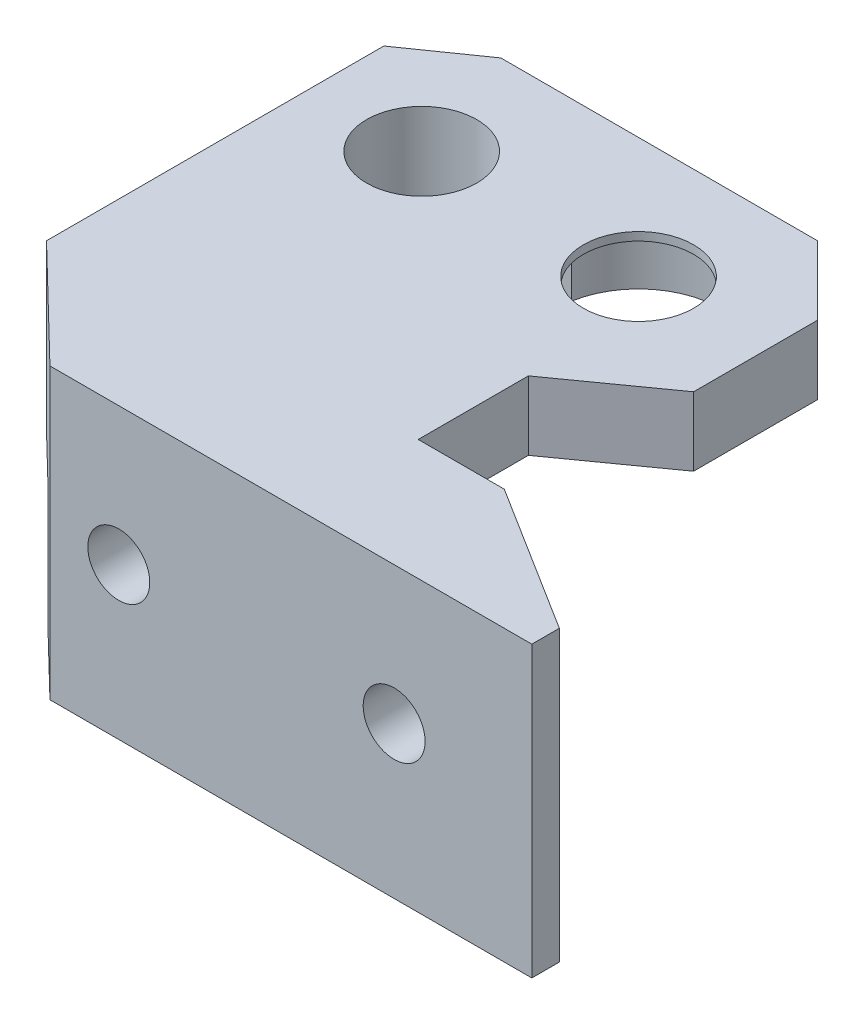
ISO-10303-21;
HEADER;
FILE_DESCRIPTION(('STEP AP214'),'2;1');
FILE_NAME('part.step','',(''),(''),'','','');
FILE_SCHEMA(('AUTOMOTIVE_DESIGN { 1 0 10303 214 1 1 1 1 }'));
ENDSEC;
DATA;
#1=APPLICATION_CONTEXT('core data for automotive mechanical design processes');
#2=APPLICATION_PROTOCOL_DEFINITION('international standard','automotive_design',2000,#1);
#3=PRODUCT_CONTEXT('',#1,'mechanical');
#4=PRODUCT('Part','Part','',(#3));
#5=PRODUCT_RELATED_PRODUCT_CATEGORY('part','',(#4));
#6=PRODUCT_DEFINITION_FORMATION('','',#4);
#7=PRODUCT_DEFINITION_CONTEXT('part definition',#1,'design');
#8=PRODUCT_DEFINITION('design','',#6,#7);
#9=PRODUCT_DEFINITION_SHAPE('','',#8);
#10=(LENGTH_UNIT() NAMED_UNIT(*) SI_UNIT(.MILLI.,.METRE.));
#11=(NAMED_UNIT(*) PLANE_ANGLE_UNIT() SI_UNIT($,.RADIAN.));
#12=(NAMED_UNIT(*) SI_UNIT($,.STERADIAN.) SOLID_ANGLE_UNIT());
#13=UNCERTAINTY_MEASURE_WITH_UNIT(LENGTH_MEASURE(1.E-05),#10,'distance_accuracy_value','');
#14=(GEOMETRIC_REPRESENTATION_CONTEXT(3) GLOBAL_UNCERTAINTY_ASSIGNED_CONTEXT((#13)) GLOBAL_UNIT_ASSIGNED_CONTEXT((#10,
#11,#12)) REPRESENTATION_CONTEXT('',''));
#15=CARTESIAN_POINT('',(0.,0.,0.));
#16=DIRECTION('',(0.,0.,1.));
#17=DIRECTION('',(1.,0.,0.));
#18=AXIS2_PLACEMENT_3D('',#15,#16,#17);
#19=CARTESIAN_POINT('',(-38.5,-7.,0.));
#20=DIRECTION('',(0.,1.,0.));
#21=DIRECTION('',(0.,0.,1.));
#22=AXIS2_PLACEMENT_3D('',#19,#20,#21);
#23=PLANE('',#22);
#24=DIRECTION('',(0.,0.,-1.));
#25=VECTOR('',#24,1.);
#26=CARTESIAN_POINT('',(-52.7141016151378,-7.,22.25));
#27=LINE('',#26,#25);
#28=CARTESIAN_POINT('',(-52.7141016151378,-7.,22.25));
#29=VERTEX_POINT('',#28);
#30=CARTESIAN_POINT('',(-52.7141016151378,-7.,18.25));
#31=VERTEX_POINT('',#30);
#32=EDGE_CURVE('E467',#29,#31,#27,.T.);
#33=ORIENTED_EDGE('',*,*,#32,.F.);
#34=DIRECTION('',(1.,0.,0.));
#35=VECTOR('',#34,1.);
#36=CARTESIAN_POINT('',(-23.6296296296296,-7.,22.25));
#37=LINE('',#36,#35);
#38=CARTESIAN_POINT('',(-59.1532258064516,-7.,22.25));
#39=VERTEX_POINT('',#38);
#40=EDGE_CURVE('E333',#39,#29,#37,.T.);
#41=ORIENTED_EDGE('',*,*,#40,.F.);
#42=DIRECTION('',(0.718240222789174,0.,0.695795215827012));
#43=VECTOR('',#42,1.);
#44=CARTESIAN_POINT('',(-59.1532258064516,-7.,22.25));
#45=LINE('',#44,#43);
#46=CARTESIAN_POINT('',(-62.25,-7.,19.25));
#47=VERTEX_POINT('',#46);
#48=EDGE_CURVE('E347',#47,#39,#45,.T.);
#49=ORIENTED_EDGE('',*,*,#48,.F.);
#50=DIRECTION('',(0.,0.,1.));
#51=VECTOR('',#50,1.);
#52=CARTESIAN_POINT('',(-62.25,-7.,19.25));
#53=LINE('',#52,#51);
#54=CARTESIAN_POINT('',(-62.25,-7.,-5.25));
#55=VERTEX_POINT('',#54);
#56=EDGE_CURVE('E538',#55,#47,#53,.T.);
#57=ORIENTED_EDGE('',*,*,#56,.F.);
#58=DIRECTION('',(-1.,0.,0.));
#59=VECTOR('',#58,1.);
#60=CARTESIAN_POINT('',(-62.25,-7.,-5.25));
#61=LINE('',#60,#59);
#62=CARTESIAN_POINT('',(-58.75,-7.,-5.25));
#63=VERTEX_POINT('',#62);
#64=EDGE_CURVE('E541',#63,#55,#61,.T.);
#65=ORIENTED_EDGE('',*,*,#64,.F.);
#66=DIRECTION('',(0.,0.,-1.));
#67=VECTOR('',#66,1.);
#68=CARTESIAN_POINT('',(-58.75,-7.,-5.25));
#69=LINE('',#68,#67);
#70=CARTESIAN_POINT('',(-58.75,-7.,18.25));
#71=VERTEX_POINT('',#70);
#72=EDGE_CURVE('E543',#71,#63,#69,.T.);
#73=ORIENTED_EDGE('',*,*,#72,.F.);
#74=DIRECTION('',(-1.,0.,0.));
#75=VECTOR('',#74,1.);
#76=CARTESIAN_POINT('',(-58.75,-7.,18.25));
#77=LINE('',#76,#75);
#78=EDGE_CURVE('E335',#31,#71,#77,.T.);
#79=ORIENTED_EDGE('',*,*,#78,.F.);
#80=EDGE_LOOP('',(#33,#41,#49,#57,#65,#73,#79));
#81=FACE_BOUND('',#80,.T.);
#82=ADVANCED_FACE('F35',(#81),#23,.F.);
#83=DIRECTION('',(0.,0.,-1.));
#84=VECTOR('',#83,1.);
#85=CARTESIAN_POINT('',(-45.7858983848622,-7.,22.25));
#86=LINE('',#85,#84);
#87=CARTESIAN_POINT('',(-45.7858983848622,-7.,18.25));
#88=VERTEX_POINT('',#87);
#89=CARTESIAN_POINT('',(-45.7858983848622,-7.,22.25));
#90=VERTEX_POINT('',#89);
#91=EDGE_CURVE('E464',#88,#90,#86,.F.);
#92=ORIENTED_EDGE('',*,*,#91,.F.);
#93=CARTESIAN_POINT('',(-32.7141016151378,-7.,18.25));
#94=VERTEX_POINT('',#93);
#95=EDGE_CURVE('E329',#94,#88,#77,.T.);
#96=ORIENTED_EDGE('',*,*,#95,.F.);
#97=DIRECTION('',(0.,0.,-1.));
#98=VECTOR('',#97,1.);
#99=CARTESIAN_POINT('',(-32.7141016151378,-7.,22.25));
#100=LINE('',#99,#98);
#101=CARTESIAN_POINT('',(-32.7141016151378,-7.,22.25));
#102=VERTEX_POINT('',#101);
#103=EDGE_CURVE('E322',#102,#94,#100,.T.);
#104=ORIENTED_EDGE('',*,*,#103,.F.);
#105=EDGE_CURVE('E331',#90,#102,#37,.T.);
#106=ORIENTED_EDGE('',*,*,#105,.F.);
#107=EDGE_LOOP('',(#92,#96,#104,#106));
#108=FACE_BOUND('',#107,.T.);
#109=ADVANCED_FACE('F294',(#108),#23,.F.);
#110=DIRECTION('',(0.,0.,-1.));
#111=VECTOR('',#110,1.);
#112=CARTESIAN_POINT('',(-25.7858983848622,-7.,22.25));
#113=LINE('',#112,#111);
#114=CARTESIAN_POINT('',(-25.7858983848622,-7.,20.8960638048539));
#115=VERTEX_POINT('',#114);
#116=CARTESIAN_POINT('',(-25.7858983848622,-7.,22.25));
#117=VERTEX_POINT('',#116);
#118=EDGE_CURVE('E315',#115,#117,#113,.F.);
#119=ORIENTED_EDGE('',*,*,#118,.F.);
#120=DIRECTION('',(-0.846889988853068,0.,-0.531768132535647));
#121=VECTOR('',#120,1.);
#122=CARTESIAN_POINT('',(-30.,-7.,18.25));
#123=LINE('',#122,#121);
#124=CARTESIAN_POINT('',(-23.6296296296296,-7.,22.25));
#125=VERTEX_POINT('',#124);
#126=EDGE_CURVE('E317',#125,#115,#123,.T.);
#127=ORIENTED_EDGE('',*,*,#126,.F.);
#128=EDGE_CURVE('E319',#117,#125,#37,.T.);
#129=ORIENTED_EDGE('',*,*,#128,.F.);
#130=EDGE_LOOP('',(#119,#127,#129));
#131=FACE_BOUND('',#130,.T.);
#132=ADVANCED_FACE('F297',(#131),#23,.F.);
#133=CARTESIAN_POINT('',(-19.25,5.,25.));
#134=DIRECTION('',(0.531768132535647,0.,-0.846889988853068));
#135=DIRECTION('',(-0.846889988853068,0.,-0.531768132535647));
#136=AXIS2_PLACEMENT_3D('',#133,#134,#135);
#137=PLANE('',#136);
#138=ORIENTED_EDGE('',*,*,#126,.T.);
#139=CARTESIAN_POINT('',(-29.25,-5.,18.7209302325581));
#140=DIRECTION('',(0.531768132535647,0.,-0.846889988853068));
#141=DIRECTION('',(-0.846889988853068,0.,-0.531768132535647));
#142=AXIS2_PLACEMENT_3D('',#139,#140,#141);
#143=ELLIPSE('',#142,4.72316363712971,4.);
#144=CARTESIAN_POINT('',(-30.,-1.07094158862457,18.25));
#145=VERTEX_POINT('',#144);
#146=EDGE_CURVE('E323',#115,#145,#143,.F.);
#147=ORIENTED_EDGE('',*,*,#146,.T.);
#148=DIRECTION('',(0.,-1.,0.));
#149=VECTOR('',#148,1.);
#150=CARTESIAN_POINT('',(-30.,5.,18.25));
#151=LINE('',#150,#149);
#152=CARTESIAN_POINT('',(-30.,5.,18.25));
#153=VERTEX_POINT('',#152);
#154=EDGE_CURVE('E414',#153,#145,#151,.T.);
#155=ORIENTED_EDGE('',*,*,#154,.F.);
#156=DIRECTION('',(0.846889988853068,0.,0.531768132535647));
#157=VECTOR('',#156,1.);
#158=CARTESIAN_POINT('',(-19.25,5.,25.));
#159=LINE('',#158,#157);
#160=CARTESIAN_POINT('',(-19.25,5.,25.));
#161=VERTEX_POINT('',#160);
#162=EDGE_CURVE('E375',#153,#161,#159,.T.);
#163=ORIENTED_EDGE('',*,*,#162,.T.);
#164=DIRECTION('',(0.,-1.,0.));
#165=VECTOR('',#164,1.);
#166=CARTESIAN_POINT('',(-19.25,5.,25.));
#167=LINE('',#166,#165);
#168=CARTESIAN_POINT('',(-19.25,-16.,25.));
#169=VERTEX_POINT('',#168);
#170=EDGE_CURVE('E225',#161,#169,#167,.T.);
#171=ORIENTED_EDGE('',*,*,#170,.T.);
#172=DIRECTION('',(-0.846889988853068,0.,-0.531768132535647));
#173=VECTOR('',#172,1.);
#174=CARTESIAN_POINT('',(-19.25,-16.,25.));
#175=LINE('',#174,#173);
#176=CARTESIAN_POINT('',(-23.6296296296296,-16.,22.25));
#177=VERTEX_POINT('',#176);
#178=EDGE_CURVE('E526',#169,#177,#175,.T.);
#179=ORIENTED_EDGE('',*,*,#178,.T.);
#180=DIRECTION('',(0.,1.,0.));
#181=VECTOR('',#180,1.);
#182=CARTESIAN_POINT('',(-23.6296296296296,-16.,22.25));
#183=LINE('',#182,#181);
#184=EDGE_CURVE('E328',#177,#125,#183,.T.);
#185=ORIENTED_EDGE('',*,*,#184,.T.);
#186=EDGE_LOOP('',(#138,#147,#155,#163,#171,#179,#185));
#187=FACE_BOUND('',#186,.T.);
#188=ADVANCED_FACE('F288',(#187),#137,.T.);
#189=CARTESIAN_POINT('',(-29.25,-5.,-8.75));
#190=DIRECTION('',(0.,0.,1.));
#191=DIRECTION('',(1.,0.,0.));
#192=AXIS2_PLACEMENT_3D('',#189,#190,#191);
#193=CYLINDRICAL_SURFACE('',#192,2.25);
#194=CARTESIAN_POINT('',(-29.25,-5.,27.));
#195=DIRECTION('',(0.,0.,-1.));
#196=DIRECTION('',(-1.,0.,0.));
#197=AXIS2_PLACEMENT_3D('',#194,#195,#196);
#198=CIRCLE('',#197,2.25);
#199=CARTESIAN_POINT('',(-31.5,-5.,27.));
#200=VERTEX_POINT('',#199);
#201=EDGE_CURVE('E469',#200,#200,#198,.T.);
#202=ORIENTED_EDGE('',*,*,#201,.F.);
#203=EDGE_LOOP('',(#202));
#204=FACE_BOUND('',#203,.T.);
#205=CARTESIAN_POINT('',(-29.25,-5.,22.25));
#206=DIRECTION('',(0.,0.,-1.));
#207=DIRECTION('',(-1.,0.,0.));
#208=AXIS2_PLACEMENT_3D('',#205,#206,#207);
#209=CIRCLE('',#208,2.25);
#210=CARTESIAN_POINT('',(-31.5,-5.,22.25));
#211=VERTEX_POINT('',#210);
#212=EDGE_CURVE('E266',#211,#211,#209,.F.);
#213=ORIENTED_EDGE('',*,*,#212,.F.);
#214=EDGE_LOOP('',(#213));
#215=FACE_BOUND('',#214,.T.);
#216=ADVANCED_FACE('F277',(#204,#215),#193,.F.);
#217=CARTESIAN_POINT('',(-49.25,-5.,-8.75));
#218=DIRECTION('',(0.,0.,1.));
#219=DIRECTION('',(1.,0.,0.));
#220=AXIS2_PLACEMENT_3D('',#217,#218,#219);
#221=CYLINDRICAL_SURFACE('',#220,2.25);
#222=CARTESIAN_POINT('',(-49.25,-5.,27.));
#223=DIRECTION('',(0.,0.,-1.));
#224=DIRECTION('',(-1.,0.,0.));
#225=AXIS2_PLACEMENT_3D('',#222,#223,#224);
#226=CIRCLE('',#225,2.25);
#227=CARTESIAN_POINT('',(-51.5,-5.,27.));
#228=VERTEX_POINT('',#227);
#229=EDGE_CURVE('E473',#228,#228,#226,.T.);
#230=ORIENTED_EDGE('',*,*,#229,.F.);
#231=EDGE_LOOP('',(#230));
#232=FACE_BOUND('',#231,.T.);
#233=CARTESIAN_POINT('',(-49.25,-5.,22.25));
#234=DIRECTION('',(0.,0.,-1.));
#235=DIRECTION('',(-1.,0.,0.));
#236=AXIS2_PLACEMENT_3D('',#233,#234,#235);
#237=CIRCLE('',#236,2.25);
#238=CARTESIAN_POINT('',(-51.5,-5.,22.25));
#239=VERTEX_POINT('',#238);
#240=EDGE_CURVE('E43',#239,#239,#237,.F.);
#241=ORIENTED_EDGE('',*,*,#240,.F.);
#242=EDGE_LOOP('',(#241));
#243=FACE_BOUND('',#242,.T.);
#244=ADVANCED_FACE('F274',(#232,#243),#221,.F.);
#245=CARTESIAN_POINT('',(-54.25,-2.5,0.));
#246=DIRECTION('',(0.,1.,0.));
#247=DIRECTION('',(0.,0.,1.));
#248=AXIS2_PLACEMENT_3D('',#245,#246,#247);
#249=CYLINDRICAL_SURFACE('',#248,7.);
#250=DIRECTION('',(0.,1.,0.));
#251=VECTOR('',#250,1.);
#252=CARTESIAN_POINT('',(-47.3217967697245,-2.5,1.));
#253=LINE('',#252,#251);
#254=CARTESIAN_POINT('',(-47.3217967697245,0.,1.));
#255=VERTEX_POINT('',#254);
#256=CARTESIAN_POINT('',(-47.3217967697245,-2.5,1.));
#257=VERTEX_POINT('',#256);
#258=EDGE_CURVE('E482',#255,#257,#253,.F.);
#259=ORIENTED_EDGE('',*,*,#258,.F.);
#260=CARTESIAN_POINT('',(-54.25,0.,0.));
#261=DIRECTION('',(0.,1.,0.));
#262=DIRECTION('',(0.,0.,-1.));
#263=AXIS2_PLACEMENT_3D('',#260,#261,#262);
#264=CIRCLE('',#263,7.);
#265=CARTESIAN_POINT('',(-58.75,0.,5.36190264738181));
#266=VERTEX_POINT('',#265);
#267=EDGE_CURVE('E519',#266,#255,#264,.T.);
#268=ORIENTED_EDGE('',*,*,#267,.F.);
#269=DIRECTION('',(0.,1.,0.));
#270=VECTOR('',#269,1.);
#271=CARTESIAN_POINT('',(-58.75,-2.5,5.36190264738181));
#272=LINE('',#271,#270);
#273=CARTESIAN_POINT('',(-58.75,-2.5,5.36190264738181));
#274=VERTEX_POINT('',#273);
#275=EDGE_CURVE('E257',#266,#274,#272,.F.);
#276=ORIENTED_EDGE('',*,*,#275,.T.);
#277=CARTESIAN_POINT('',(-54.25,-2.5,0.));
#278=DIRECTION('',(0.,1.,0.));
#279=DIRECTION('',(0.,0.,-1.));
#280=AXIS2_PLACEMENT_3D('',#277,#278,#279);
#281=CIRCLE('',#280,7.);
#282=EDGE_CURVE('E515',#274,#257,#281,.T.);
#283=ORIENTED_EDGE('',*,*,#282,.T.);
#284=EDGE_LOOP('',(#259,#268,#276,#283));
#285=FACE_BOUND('',#284,.T.);
#286=ADVANCED_FACE('F276',(#285),#249,.T.);
#287=CARTESIAN_POINT('',(-38.5,0.,0.));
#288=DIRECTION('',(0.,1.,0.));
#289=DIRECTION('',(0.,0.,1.));
#290=AXIS2_PLACEMENT_3D('',#287,#288,#289);
#291=PLANE('',#290);
#292=DIRECTION('',(-1.,0.,0.));
#293=VECTOR('',#292,1.);
#294=CARTESIAN_POINT('',(-44.3837822935834,0.,-1.));
#295=LINE('',#294,#293);
#296=CARTESIAN_POINT('',(-44.3837822935834,0.,-1.));
#297=VERTEX_POINT('',#296);
#298=CARTESIAN_POINT('',(-47.3217967697245,0.,-1.));
#299=VERTEX_POINT('',#298);
#300=EDGE_CURVE('E492',#297,#299,#295,.T.);
#301=ORIENTED_EDGE('',*,*,#300,.T.);
#302=CARTESIAN_POINT('',(-58.880064794363,0.,-5.25));
#303=VERTEX_POINT('',#302);
#304=EDGE_CURVE('E514',#299,#303,#264,.T.);
#305=ORIENTED_EDGE('',*,*,#304,.T.);
#306=DIRECTION('',(-1.,0.,0.));
#307=VECTOR('',#306,1.);
#308=CARTESIAN_POINT('',(-62.25,0.,-5.25));
#309=LINE('',#308,#307);
#310=CARTESIAN_POINT('',(-62.25,0.,-5.25));
#311=VERTEX_POINT('',#310);
#312=EDGE_CURVE('E341',#303,#311,#309,.T.);
#313=ORIENTED_EDGE('',*,*,#312,.T.);
#314=DIRECTION('',(0.819231920519041,0.,-0.573462344363328));
#315=VECTOR('',#314,1.);
#316=CARTESIAN_POINT('',(-57.25,0.,-8.75));
#317=LINE('',#316,#315);
#318=CARTESIAN_POINT('',(-57.25,0.,-8.75));
#319=VERTEX_POINT('',#318);
#320=EDGE_CURVE('E395',#311,#319,#317,.T.);
#321=ORIENTED_EDGE('',*,*,#320,.T.);
#322=DIRECTION('',(1.,0.,0.));
#323=VECTOR('',#322,1.);
#324=CARTESIAN_POINT('',(-34.25,0.,-8.75));
#325=LINE('',#324,#323);
#326=CARTESIAN_POINT('',(-34.25,0.,-8.75));
#327=VERTEX_POINT('',#326);
#328=EDGE_CURVE('E392',#319,#327,#325,.T.);
#329=ORIENTED_EDGE('',*,*,#328,.T.);
#330=DIRECTION('',(0.707106781186547,0.,0.707106781186548));
#331=VECTOR('',#330,1.);
#332=CARTESIAN_POINT('',(-29.25,0.,-3.75));
#333=LINE('',#332,#331);
#334=CARTESIAN_POINT('',(-29.25,0.,-3.75));
#335=VERTEX_POINT('',#334);
#336=EDGE_CURVE('E360',#327,#335,#333,.T.);
#337=ORIENTED_EDGE('',*,*,#336,.T.);
#338=DIRECTION('',(0.,0.,1.));
#339=VECTOR('',#338,1.);
#340=CARTESIAN_POINT('',(-29.25,0.,5.25));
#341=LINE('',#340,#339);
#342=CARTESIAN_POINT('',(-29.25,0.,5.25));
#343=VERTEX_POINT('',#342);
#344=EDGE_CURVE('E365',#335,#343,#341,.T.);
#345=ORIENTED_EDGE('',*,*,#344,.T.);
#346=DIRECTION('',(-0.813733471206735,0.,0.581238193719096));
#347=VECTOR('',#346,1.);
#348=CARTESIAN_POINT('',(-36.25,0.,10.25));
#349=LINE('',#348,#347);
#350=CARTESIAN_POINT('',(-36.25,0.,10.25));
#351=VERTEX_POINT('',#350);
#352=EDGE_CURVE('E401',#343,#351,#349,.T.);
#353=ORIENTED_EDGE('',*,*,#352,.T.);
#354=DIRECTION('',(0.,0.,1.));
#355=VECTOR('',#354,1.);
#356=CARTESIAN_POINT('',(-36.25,0.,18.25));
#357=LINE('',#356,#355);
#358=CARTESIAN_POINT('',(-36.25,0.,18.25));
#359=VERTEX_POINT('',#358);
#360=EDGE_CURVE('E398',#351,#359,#357,.T.);
#361=ORIENTED_EDGE('',*,*,#360,.T.);
#362=DIRECTION('',(-1.,0.,0.));
#363=VECTOR('',#362,1.);
#364=CARTESIAN_POINT('',(-38.5,0.,18.25));
#365=LINE('',#364,#363);
#366=CARTESIAN_POINT('',(-58.75,0.,18.25));
#367=VERTEX_POINT('',#366);
#368=EDGE_CURVE('E246',#359,#367,#365,.T.);
#369=ORIENTED_EDGE('',*,*,#368,.T.);
#370=DIRECTION('',(0.,0.,-1.));
#371=VECTOR('',#370,1.);
#372=CARTESIAN_POINT('',(-58.75,0.,-5.25));
#373=LINE('',#372,#371);
#374=EDGE_CURVE('E343',#367,#266,#373,.T.);
#375=ORIENTED_EDGE('',*,*,#374,.T.);
#376=ORIENTED_EDGE('',*,*,#267,.T.);
#377=DIRECTION('',(1.,0.,0.));
#378=VECTOR('',#377,1.);
#379=CARTESIAN_POINT('',(-44.3837822935834,0.,1.));
#380=LINE('',#379,#378);
#381=CARTESIAN_POINT('',(-44.3837822935834,0.,1.));
#382=VERTEX_POINT('',#381);
#383=EDGE_CURVE('E500',#255,#382,#380,.T.);
#384=ORIENTED_EDGE('',*,*,#383,.T.);
#385=CARTESIAN_POINT('',(-38.5,0.,0.));
#386=DIRECTION('',(0.,1.,0.));
#387=DIRECTION('',(0.,0.,-1.));
#388=AXIS2_PLACEMENT_3D('',#385,#386,#387);
#389=CIRCLE('',#388,5.96815667340306);
#390=EDGE_CURVE('E487',#382,#297,#389,.T.);
#391=ORIENTED_EDGE('',*,*,#390,.T.);
#392=EDGE_LOOP('',(#301,#305,#313,#321,#329,#337,#345,#353,#361,#369,#375,#376,#384,#391));
#393=FACE_BOUND('',#392,.T.);
#394=ADVANCED_FACE('F284',(#393),#291,.F.);
#395=CARTESIAN_POINT('',(-38.5,5.,0.));
#396=DIRECTION('',(0.,-1.,0.));
#397=DIRECTION('',(0.,0.,-1.));
#398=AXIS2_PLACEMENT_3D('',#395,#396,#397);
#399=CYLINDRICAL_SURFACE('',#398,4.);
#400=CARTESIAN_POINT('',(-38.5,5.,0.));
#401=DIRECTION('',(0.,-1.,0.));
#402=DIRECTION('',(0.,0.,1.));
#403=AXIS2_PLACEMENT_3D('',#400,#401,#402);
#404=CIRCLE('',#403,4.);
#405=CARTESIAN_POINT('',(-38.5,5.,4.));
#406=VERTEX_POINT('',#405);
#407=EDGE_CURVE('E357',#406,#406,#404,.T.);
#408=ORIENTED_EDGE('',*,*,#407,.F.);
#409=EDGE_LOOP('',(#408));
#410=FACE_BOUND('',#409,.T.);
#411=CARTESIAN_POINT('',(-38.5,4.4,0.));
#412=DIRECTION('',(0.,-1.,0.));
#413=DIRECTION('',(0.,0.,-1.));
#414=AXIS2_PLACEMENT_3D('',#411,#412,#413);
#415=CIRCLE('',#414,4.);
#416=CARTESIAN_POINT('',(-38.5,4.4,-4.));
#417=VERTEX_POINT('',#416);
#418=EDGE_CURVE('E507',#417,#417,#415,.F.);
#419=ORIENTED_EDGE('',*,*,#418,.F.);
#420=EDGE_LOOP('',(#419));
#421=FACE_BOUND('',#420,.T.);
#422=ADVANCED_FACE('F590',(#410,#421),#399,.F.);
#423=CARTESIAN_POINT('',(-54.25,5.,0.));
#424=DIRECTION('',(0.,-1.,0.));
#425=DIRECTION('',(0.,0.,-1.));
#426=AXIS2_PLACEMENT_3D('',#423,#424,#425);
#427=CYLINDRICAL_SURFACE('',#426,4.);
#428=DIRECTION('',(0.,-1.,0.));
#429=VECTOR('',#428,1.);
#430=CARTESIAN_POINT('',(-50.3770166537926,5.,1.));
#431=LINE('',#430,#429);
#432=CARTESIAN_POINT('',(-50.3770166537926,-2.5,0.999999999999999));
#433=VERTEX_POINT('',#432);
#434=CARTESIAN_POINT('',(-50.3770166537926,4.4,1.));
#435=VERTEX_POINT('',#434);
#436=EDGE_CURVE('E260',#433,#435,#431,.F.);
#437=ORIENTED_EDGE('',*,*,#436,.F.);
#438=CARTESIAN_POINT('',(-54.25,-2.5,0.));
#439=DIRECTION('',(0.,1.,0.));
#440=DIRECTION('',(0.,0.,-1.));
#441=AXIS2_PLACEMENT_3D('',#438,#439,#440);
#442=CIRCLE('',#441,4.);
#443=CARTESIAN_POINT('',(-50.3770166537926,-2.5,-1.));
#444=VERTEX_POINT('',#443);
#445=EDGE_CURVE('E511',#444,#433,#442,.T.);
#446=ORIENTED_EDGE('',*,*,#445,.F.);
#447=DIRECTION('',(0.,-1.,0.));
#448=VECTOR('',#447,1.);
#449=CARTESIAN_POINT('',(-50.3770166537926,5.,-1.));
#450=LINE('',#449,#448);
#451=CARTESIAN_POINT('',(-50.3770166537926,4.4,-1.));
#452=VERTEX_POINT('',#451);
#453=EDGE_CURVE('E262',#452,#444,#450,.T.);
#454=ORIENTED_EDGE('',*,*,#453,.F.);
#455=CARTESIAN_POINT('',(-54.25,4.4,0.));
#456=DIRECTION('',(0.,-1.,0.));
#457=DIRECTION('',(0.,0.,-1.));
#458=AXIS2_PLACEMENT_3D('',#455,#456,#457);
#459=CIRCLE('',#458,4.);
#460=EDGE_CURVE('E264',#435,#452,#459,.F.);
#461=ORIENTED_EDGE('',*,*,#460,.F.);
#462=EDGE_LOOP('',(#437,#446,#454,#461));
#463=FACE_BOUND('',#462,.T.);
#464=CARTESIAN_POINT('',(-54.25,5.,0.));
#465=DIRECTION('',(0.,-1.,0.));
#466=DIRECTION('',(0.,0.,1.));
#467=AXIS2_PLACEMENT_3D('',#464,#465,#466);
#468=CIRCLE('',#467,4.);
#469=CARTESIAN_POINT('',(-54.25,5.,4.));
#470=VERTEX_POINT('',#469);
#471=EDGE_CURVE('E354',#470,#470,#468,.T.);
#472=ORIENTED_EDGE('',*,*,#471,.F.);
#473=EDGE_LOOP('',(#472));
#474=FACE_BOUND('',#473,.T.);
#475=ADVANCED_FACE('F580',(#463,#474),#427,.F.);
#476=CARTESIAN_POINT('',(0.,5.,0.));
#477=DIRECTION('',(0.,1.,0.));
#478=DIRECTION('',(0.,0.,1.));
#479=AXIS2_PLACEMENT_3D('',#476,#477,#478);
#480=PLANE('',#479);
#481=DIRECTION('',(0.,0.,1.));
#482=VECTOR('',#481,1.);
#483=CARTESIAN_POINT('',(-19.25,5.,27.));
#484=LINE('',#483,#482);
#485=CARTESIAN_POINT('',(-19.25,5.,27.));
#486=VERTEX_POINT('',#485);
#487=EDGE_CURVE('E222',#161,#486,#484,.T.);
#488=ORIENTED_EDGE('',*,*,#487,.F.);
#489=ORIENTED_EDGE('',*,*,#162,.F.);
#490=DIRECTION('',(1.,0.,0.));
#491=VECTOR('',#490,1.);
#492=CARTESIAN_POINT('',(-30.,5.,18.25));
#493=LINE('',#492,#491);
#494=CARTESIAN_POINT('',(-36.25,5.,18.25));
#495=VERTEX_POINT('',#494);
#496=EDGE_CURVE('E377',#495,#153,#493,.T.);
#497=ORIENTED_EDGE('',*,*,#496,.F.);
#498=DIRECTION('',(0.,0.,1.));
#499=VECTOR('',#498,1.);
#500=CARTESIAN_POINT('',(-36.25,5.,18.25));
#501=LINE('',#500,#499);
#502=CARTESIAN_POINT('',(-36.25,5.,10.25));
#503=VERTEX_POINT('',#502);
#504=EDGE_CURVE('E380',#503,#495,#501,.T.);
#505=ORIENTED_EDGE('',*,*,#504,.F.);
#506=DIRECTION('',(-0.813733471206735,0.,0.581238193719096));
#507=VECTOR('',#506,1.);
#508=CARTESIAN_POINT('',(-36.25,5.,10.25));
#509=LINE('',#508,#507);
#510=CARTESIAN_POINT('',(-29.25,5.,5.25));
#511=VERTEX_POINT('',#510);
#512=EDGE_CURVE('E383',#511,#503,#509,.T.);
#513=ORIENTED_EDGE('',*,*,#512,.F.);
#514=DIRECTION('',(0.,0.,1.));
#515=VECTOR('',#514,1.);
#516=CARTESIAN_POINT('',(-29.25,5.,5.25));
#517=LINE('',#516,#515);
#518=CARTESIAN_POINT('',(-29.25,5.,-3.75));
#519=VERTEX_POINT('',#518);
#520=EDGE_CURVE('E386',#519,#511,#517,.T.);
#521=ORIENTED_EDGE('',*,*,#520,.F.);
#522=DIRECTION('',(0.707106781186547,0.,0.707106781186548));
#523=VECTOR('',#522,1.);
#524=CARTESIAN_POINT('',(-29.25,5.,-3.75));
#525=LINE('',#524,#523);
#526=CARTESIAN_POINT('',(-34.25,5.,-8.75));
#527=VERTEX_POINT('',#526);
#528=EDGE_CURVE('E361',#527,#519,#525,.T.);
#529=ORIENTED_EDGE('',*,*,#528,.F.);
#530=DIRECTION('',(1.,0.,0.));
#531=VECTOR('',#530,1.);
#532=CARTESIAN_POINT('',(-34.25,5.,-8.75));
#533=LINE('',#532,#531);
#534=CARTESIAN_POINT('',(-57.25,5.,-8.75));
#535=VERTEX_POINT('',#534);
#536=EDGE_CURVE('E364',#535,#527,#533,.T.);
#537=ORIENTED_EDGE('',*,*,#536,.F.);
#538=DIRECTION('',(0.819231920519041,0.,-0.573462344363328));
#539=VECTOR('',#538,1.);
#540=CARTESIAN_POINT('',(-57.25,5.,-8.75));
#541=LINE('',#540,#539);
#542=CARTESIAN_POINT('',(-62.25,5.,-5.25));
#543=VERTEX_POINT('',#542);
#544=EDGE_CURVE('E368',#543,#535,#541,.T.);
#545=ORIENTED_EDGE('',*,*,#544,.F.);
#546=DIRECTION('',(0.,0.,-1.));
#547=VECTOR('',#546,1.);
#548=CARTESIAN_POINT('',(-62.25,5.,-5.25));
#549=LINE('',#548,#547);
#550=CARTESIAN_POINT('',(-62.25,5.,19.25));
#551=VERTEX_POINT('',#550);
#552=EDGE_CURVE('E371',#551,#543,#549,.T.);
#553=ORIENTED_EDGE('',*,*,#552,.F.);
#554=DIRECTION('',(-0.718240222789174,0.,-0.695795215827012));
#555=VECTOR('',#554,1.);
#556=CARTESIAN_POINT('',(-62.25,5.,19.25));
#557=LINE('',#556,#555);
#558=CARTESIAN_POINT('',(-54.25,5.,27.));
#559=VERTEX_POINT('',#558);
#560=EDGE_CURVE('E244',#559,#551,#557,.T.);
#561=ORIENTED_EDGE('',*,*,#560,.F.);
#562=DIRECTION('',(1.,0.,0.));
#563=VECTOR('',#562,1.);
#564=CARTESIAN_POINT('',(15.75,5.,27.));
#565=LINE('',#564,#563);
#566=EDGE_CURVE('E234',#559,#486,#565,.T.);
#567=ORIENTED_EDGE('',*,*,#566,.T.);
#568=EDGE_LOOP('',(#488,#489,#497,#505,#513,#521,#529,#537,#545,#553,#561,#567));
#569=FACE_BOUND('',#568,.T.);
#570=ORIENTED_EDGE('',*,*,#471,.T.);
#571=EDGE_LOOP('',(#570));
#572=FACE_BOUND('',#571,.T.);
#573=ORIENTED_EDGE('',*,*,#407,.T.);
#574=EDGE_LOOP('',(#573));
#575=FACE_BOUND('',#574,.T.);
#576=ADVANCED_FACE('F240',(#569,#572,#575),#480,.T.);
#577=CARTESIAN_POINT('',(15.75,5.,27.));
#578=DIRECTION('',(0.,0.,-1.));
#579=DIRECTION('',(-1.,0.,0.));
#580=AXIS2_PLACEMENT_3D('',#577,#578,#579);
#581=PLANE('',#580);
#582=ORIENTED_EDGE('',*,*,#229,.T.);
#583=EDGE_LOOP('',(#582));
#584=FACE_BOUND('',#583,.T.);
#585=ORIENTED_EDGE('',*,*,#201,.T.);
#586=EDGE_LOOP('',(#585));
#587=FACE_BOUND('',#586,.T.);
#588=DIRECTION('',(-1.,0.,0.));
#589=VECTOR('',#588,1.);
#590=CARTESIAN_POINT('',(15.75,-16.,27.));
#591=LINE('',#590,#589);
#592=CARTESIAN_POINT('',(-19.25,-16.,27.));
#593=VERTEX_POINT('',#592);
#594=CARTESIAN_POINT('',(-54.25,-16.,27.));
#595=VERTEX_POINT('',#594);
#596=EDGE_CURVE('E236',#593,#595,#591,.T.);
#597=ORIENTED_EDGE('',*,*,#596,.F.);
#598=DIRECTION('',(0.,1.,0.));
#599=VECTOR('',#598,1.);
#600=CARTESIAN_POINT('',(-19.25,-16.,27.));
#601=LINE('',#600,#599);
#602=EDGE_CURVE('E50',#593,#486,#601,.T.);
#603=ORIENTED_EDGE('',*,*,#602,.T.);
#604=ORIENTED_EDGE('',*,*,#566,.F.);
#605=DIRECTION('',(0.,-1.,0.));
#606=VECTOR('',#605,1.);
#607=CARTESIAN_POINT('',(-54.25,5.,27.));
#608=LINE('',#607,#606);
#609=EDGE_CURVE('E416',#559,#595,#608,.T.);
#610=ORIENTED_EDGE('',*,*,#609,.T.);
#611=EDGE_LOOP('',(#597,#603,#604,#610));
#612=FACE_BOUND('',#611,.T.);
#613=ADVANCED_FACE('F37',(#584,#587,#612),#581,.F.);
#614=CARTESIAN_POINT('',(0.,-16.,0.));
#615=DIRECTION('',(0.,1.,0.));
#616=DIRECTION('',(0.,0.,1.));
#617=AXIS2_PLACEMENT_3D('',#614,#615,#616);
#618=PLANE('',#617);
#619=ORIENTED_EDGE('',*,*,#178,.F.);
#620=DIRECTION('',(0.,0.,1.));
#621=VECTOR('',#620,1.);
#622=CARTESIAN_POINT('',(-19.25,-16.,0.));
#623=LINE('',#622,#621);
#624=EDGE_CURVE('E11',#169,#593,#623,.T.);
#625=ORIENTED_EDGE('',*,*,#624,.T.);
#626=ORIENTED_EDGE('',*,*,#596,.T.);
#627=DIRECTION('',(0.718240222789174,0.,0.695795215827012));
#628=VECTOR('',#627,1.);
#629=CARTESIAN_POINT('',(-59.1532258064516,-16.,22.25));
#630=LINE('',#629,#628);
#631=CARTESIAN_POINT('',(-59.1532258064516,-16.,22.25));
#632=VERTEX_POINT('',#631);
#633=EDGE_CURVE('E528',#632,#595,#630,.T.);
#634=ORIENTED_EDGE('',*,*,#633,.F.);
#635=DIRECTION('',(-1.,0.,0.));
#636=VECTOR('',#635,1.);
#637=CARTESIAN_POINT('',(-23.6296296296296,-16.,22.25));
#638=LINE('',#637,#636);
#639=EDGE_CURVE('E531',#177,#632,#638,.T.);
#640=ORIENTED_EDGE('',*,*,#639,.F.);
#641=EDGE_LOOP('',(#619,#625,#626,#634,#640));
#642=FACE_BOUND('',#641,.T.);
#643=ADVANCED_FACE('F625',(#642),#618,.F.);
#644=CARTESIAN_POINT('',(-29.25,5.,-3.75));
#645=DIRECTION('',(0.707106781186548,0.,-0.707106781186547));
#646=DIRECTION('',(-0.707106781186547,0.,-0.707106781186548));
#647=AXIS2_PLACEMENT_3D('',#644,#645,#646);
#648=PLANE('',#647);
#649=ORIENTED_EDGE('',*,*,#336,.F.);
#650=DIRECTION('',(0.,-1.,0.));
#651=VECTOR('',#650,1.);
#652=CARTESIAN_POINT('',(-34.25,5.,-8.75));
#653=LINE('',#652,#651);
#654=EDGE_CURVE('E248',#527,#327,#653,.T.);
#655=ORIENTED_EDGE('',*,*,#654,.F.);
#656=ORIENTED_EDGE('',*,*,#528,.T.);
#657=DIRECTION('',(0.,-1.,0.));
#658=VECTOR('',#657,1.);
#659=CARTESIAN_POINT('',(-29.25,5.,-3.75));
#660=LINE('',#659,#658);
#661=EDGE_CURVE('E389',#519,#335,#660,.T.);
#662=ORIENTED_EDGE('',*,*,#661,.T.);
#663=EDGE_LOOP('',(#649,#655,#656,#662));
#664=FACE_BOUND('',#663,.T.);
#665=ADVANCED_FACE('F431',(#664),#648,.T.);
#666=CARTESIAN_POINT('',(-34.25,5.,-8.75));
#667=DIRECTION('',(0.,0.,-1.));
#668=DIRECTION('',(-1.,0.,0.));
#669=AXIS2_PLACEMENT_3D('',#666,#667,#668);
#670=PLANE('',#669);
#671=ORIENTED_EDGE('',*,*,#328,.F.);
#672=DIRECTION('',(0.,-1.,0.));
#673=VECTOR('',#672,1.);
#674=CARTESIAN_POINT('',(-57.25,5.,-8.75));
#675=LINE('',#674,#673);
#676=EDGE_CURVE('E423',#535,#319,#675,.T.);
#677=ORIENTED_EDGE('',*,*,#676,.F.);
#678=ORIENTED_EDGE('',*,*,#536,.T.);
#679=ORIENTED_EDGE('',*,*,#654,.T.);
#680=EDGE_LOOP('',(#671,#677,#678,#679));
#681=FACE_BOUND('',#680,.T.);
#682=ADVANCED_FACE('F427',(#681),#670,.T.);
#683=CARTESIAN_POINT('',(-57.25,5.,-8.75));
#684=DIRECTION('',(-0.573462344363328,0.,-0.819231920519041));
#685=DIRECTION('',(-0.819231920519041,0.,0.573462344363328));
#686=AXIS2_PLACEMENT_3D('',#683,#684,#685);
#687=PLANE('',#686);
#688=ORIENTED_EDGE('',*,*,#320,.F.);
#689=DIRECTION('',(0.,-1.,0.));
#690=VECTOR('',#689,1.);
#691=CARTESIAN_POINT('',(-62.25,5.,-5.25));
#692=LINE('',#691,#690);
#693=EDGE_CURVE('E420',#543,#311,#692,.T.);
#694=ORIENTED_EDGE('',*,*,#693,.F.);
#695=ORIENTED_EDGE('',*,*,#544,.T.);
#696=ORIENTED_EDGE('',*,*,#676,.T.);
#697=EDGE_LOOP('',(#688,#694,#695,#696));
#698=FACE_BOUND('',#697,.T.);
#699=ADVANCED_FACE('F438',(#698),#687,.T.);
#700=CARTESIAN_POINT('',(-62.25,5.,-5.25));
#701=DIRECTION('',(-1.,0.,0.));
#702=DIRECTION('',(0.,0.,1.));
#703=AXIS2_PLACEMENT_3D('',#700,#701,#702);
#704=PLANE('',#703);
#705=ORIENTED_EDGE('',*,*,#693,.T.);
#706=DIRECTION('',(0.,1.,0.));
#707=VECTOR('',#706,1.);
#708=CARTESIAN_POINT('',(-62.25,-7.,-5.25));
#709=LINE('',#708,#707);
#710=EDGE_CURVE('E351',#55,#311,#709,.T.);
#711=ORIENTED_EDGE('',*,*,#710,.F.);
#712=ORIENTED_EDGE('',*,*,#56,.T.);
#713=DIRECTION('',(0.,-1.,0.));
#714=VECTOR('',#713,1.);
#715=CARTESIAN_POINT('',(-62.25,5.,19.25));
#716=LINE('',#715,#714);
#717=EDGE_CURVE('E418',#551,#47,#716,.T.);
#718=ORIENTED_EDGE('',*,*,#717,.F.);
#719=ORIENTED_EDGE('',*,*,#552,.T.);
#720=EDGE_LOOP('',(#705,#711,#712,#718,#719));
#721=FACE_BOUND('',#720,.T.);
#722=ADVANCED_FACE('F614',(#721),#704,.T.);
#723=CARTESIAN_POINT('',(-62.25,5.,19.25));
#724=DIRECTION('',(-0.695795215827012,0.,0.718240222789174));
#725=DIRECTION('',(0.718240222789174,0.,0.695795215827012));
#726=AXIS2_PLACEMENT_3D('',#723,#724,#725);
#727=PLANE('',#726);
#728=ORIENTED_EDGE('',*,*,#633,.T.);
#729=ORIENTED_EDGE('',*,*,#609,.F.);
#730=ORIENTED_EDGE('',*,*,#560,.T.);
#731=ORIENTED_EDGE('',*,*,#717,.T.);
#732=ORIENTED_EDGE('',*,*,#48,.T.);
#733=DIRECTION('',(0.,1.,0.));
#734=VECTOR('',#733,1.);
#735=CARTESIAN_POINT('',(-59.1532258064516,-16.,22.25));
#736=LINE('',#735,#734);
#737=EDGE_CURVE('E344',#632,#39,#736,.T.);
#738=ORIENTED_EDGE('',*,*,#737,.F.);
#739=EDGE_LOOP('',(#728,#729,#730,#731,#732,#738));
#740=FACE_BOUND('',#739,.T.);
#741=ADVANCED_FACE('F610',(#740),#727,.T.);
#742=CARTESIAN_POINT('',(-30.,5.,18.25));
#743=DIRECTION('',(0.,0.,-1.));
#744=DIRECTION('',(-1.,0.,0.));
#745=AXIS2_PLACEMENT_3D('',#742,#743,#744);
#746=PLANE('',#745);
#747=ORIENTED_EDGE('',*,*,#95,.T.);
#748=CARTESIAN_POINT('',(-49.25,-5.,18.25));
#749=DIRECTION('',(0.,0.,1.));
#750=DIRECTION('',(1.,0.,0.));
#751=AXIS2_PLACEMENT_3D('',#748,#749,#750);
#752=CIRCLE('',#751,4.);
#753=EDGE_CURVE('E550',#88,#31,#752,.T.);
#754=ORIENTED_EDGE('',*,*,#753,.T.);
#755=ORIENTED_EDGE('',*,*,#78,.T.);
#756=DIRECTION('',(0.,1.,0.));
#757=VECTOR('',#756,1.);
#758=CARTESIAN_POINT('',(-58.75,-7.,18.25));
#759=LINE('',#758,#757);
#760=EDGE_CURVE('E340',#71,#367,#759,.T.);
#761=ORIENTED_EDGE('',*,*,#760,.T.);
#762=ORIENTED_EDGE('',*,*,#368,.F.);
#763=DIRECTION('',(0.,-1.,0.));
#764=VECTOR('',#763,1.);
#765=CARTESIAN_POINT('',(-36.25,5.,18.25));
#766=LINE('',#765,#764);
#767=EDGE_CURVE('E411',#495,#359,#766,.T.);
#768=ORIENTED_EDGE('',*,*,#767,.F.);
#769=ORIENTED_EDGE('',*,*,#496,.T.);
#770=ORIENTED_EDGE('',*,*,#154,.T.);
#771=CARTESIAN_POINT('',(-29.25,-5.,18.25));
#772=DIRECTION('',(0.,0.,1.));
#773=DIRECTION('',(1.,0.,0.));
#774=AXIS2_PLACEMENT_3D('',#771,#772,#773);
#775=CIRCLE('',#774,4.);
#776=EDGE_CURVE('E237',#145,#94,#775,.T.);
#777=ORIENTED_EDGE('',*,*,#776,.T.);
#778=EDGE_LOOP('',(#747,#754,#755,#761,#762,#768,#769,#770,#777));
#779=FACE_BOUND('',#778,.T.);
#780=ADVANCED_FACE('F453',(#779),#746,.T.);
#781=CARTESIAN_POINT('',(-36.25,5.,18.25));
#782=DIRECTION('',(1.,0.,0.));
#783=DIRECTION('',(0.,0.,-1.));
#784=AXIS2_PLACEMENT_3D('',#781,#782,#783);
#785=PLANE('',#784);
#786=ORIENTED_EDGE('',*,*,#360,.F.);
#787=DIRECTION('',(0.,-1.,0.));
#788=VECTOR('',#787,1.);
#789=CARTESIAN_POINT('',(-36.25,5.,10.25));
#790=LINE('',#789,#788);
#791=EDGE_CURVE('E409',#503,#351,#790,.T.);
#792=ORIENTED_EDGE('',*,*,#791,.F.);
#793=ORIENTED_EDGE('',*,*,#504,.T.);
#794=ORIENTED_EDGE('',*,*,#767,.T.);
#795=EDGE_LOOP('',(#786,#792,#793,#794));
#796=FACE_BOUND('',#795,.T.);
#797=ADVANCED_FACE('F450',(#796),#785,.T.);
#798=CARTESIAN_POINT('',(-36.25,5.,10.25));
#799=DIRECTION('',(0.581238193719096,0.,0.813733471206735));
#800=DIRECTION('',(0.813733471206735,0.,-0.581238193719096));
#801=AXIS2_PLACEMENT_3D('',#798,#799,#800);
#802=PLANE('',#801);
#803=ORIENTED_EDGE('',*,*,#352,.F.);
#804=DIRECTION('',(0.,-1.,0.));
#805=VECTOR('',#804,1.);
#806=CARTESIAN_POINT('',(-29.25,5.,5.25));
#807=LINE('',#806,#805);
#808=EDGE_CURVE('E407',#511,#343,#807,.T.);
#809=ORIENTED_EDGE('',*,*,#808,.F.);
#810=ORIENTED_EDGE('',*,*,#512,.T.);
#811=ORIENTED_EDGE('',*,*,#791,.T.);
#812=EDGE_LOOP('',(#803,#809,#810,#811));
#813=FACE_BOUND('',#812,.T.);
#814=ADVANCED_FACE('F448',(#813),#802,.T.);
#815=CARTESIAN_POINT('',(-29.25,5.,5.25));
#816=DIRECTION('',(1.,0.,0.));
#817=DIRECTION('',(0.,0.,-1.));
#818=AXIS2_PLACEMENT_3D('',#815,#816,#817);
#819=PLANE('',#818);
#820=ORIENTED_EDGE('',*,*,#344,.F.);
#821=ORIENTED_EDGE('',*,*,#661,.F.);
#822=ORIENTED_EDGE('',*,*,#520,.T.);
#823=ORIENTED_EDGE('',*,*,#808,.T.);
#824=EDGE_LOOP('',(#820,#821,#822,#823));
#825=FACE_BOUND('',#824,.T.);
#826=ADVANCED_FACE('F444',(#825),#819,.T.);
#827=CARTESIAN_POINT('',(-62.25,-7.,-5.25));
#828=DIRECTION('',(0.,0.,-1.));
#829=DIRECTION('',(-1.,0.,0.));
#830=AXIS2_PLACEMENT_3D('',#827,#828,#829);
#831=PLANE('',#830);
#832=DIRECTION('',(0.,1.,0.));
#833=VECTOR('',#832,1.);
#834=CARTESIAN_POINT('',(-58.880064794363,-2.5,-5.25));
#835=LINE('',#834,#833);
#836=CARTESIAN_POINT('',(-58.880064794363,-2.5,-5.25));
#837=VERTEX_POINT('',#836);
#838=EDGE_CURVE('E524',#837,#303,#835,.T.);
#839=ORIENTED_EDGE('',*,*,#838,.F.);
#840=DIRECTION('',(-1.,0.,0.));
#841=VECTOR('',#840,1.);
#842=CARTESIAN_POINT('',(-62.25,-2.5,-5.25));
#843=LINE('',#842,#841);
#844=CARTESIAN_POINT('',(-58.75,-2.5,-5.25));
#845=VERTEX_POINT('',#844);
#846=EDGE_CURVE('E518',#845,#837,#843,.T.);
#847=ORIENTED_EDGE('',*,*,#846,.F.);
#848=DIRECTION('',(0.,1.,0.));
#849=VECTOR('',#848,1.);
#850=CARTESIAN_POINT('',(-58.75,-7.,-5.25));
#851=LINE('',#850,#849);
#852=EDGE_CURVE('E349',#63,#845,#851,.T.);
#853=ORIENTED_EDGE('',*,*,#852,.F.);
#854=ORIENTED_EDGE('',*,*,#64,.T.);
#855=ORIENTED_EDGE('',*,*,#710,.T.);
#856=ORIENTED_EDGE('',*,*,#312,.F.);
#857=EDGE_LOOP('',(#839,#847,#853,#854,#855,#856));
#858=FACE_BOUND('',#857,.T.);
#859=ADVANCED_FACE('F556',(#858),#831,.T.);
#860=CARTESIAN_POINT('',(-58.75,-7.,-5.25));
#861=DIRECTION('',(1.,0.,0.));
#862=DIRECTION('',(0.,0.,-1.));
#863=AXIS2_PLACEMENT_3D('',#860,#861,#862);
#864=PLANE('',#863);
#865=ORIENTED_EDGE('',*,*,#275,.F.);
#866=ORIENTED_EDGE('',*,*,#374,.F.);
#867=ORIENTED_EDGE('',*,*,#760,.F.);
#868=ORIENTED_EDGE('',*,*,#72,.T.);
#869=ORIENTED_EDGE('',*,*,#852,.T.);
#870=DIRECTION('',(0.,0.,-1.));
#871=VECTOR('',#870,1.);
#872=CARTESIAN_POINT('',(-58.75,-2.5,-5.25));
#873=LINE('',#872,#871);
#874=EDGE_CURVE('E254',#274,#845,#873,.T.);
#875=ORIENTED_EDGE('',*,*,#874,.F.);
#876=EDGE_LOOP('',(#865,#866,#867,#868,#869,#875));
#877=FACE_BOUND('',#876,.T.);
#878=ADVANCED_FACE('F551',(#877),#864,.T.);
#879=CARTESIAN_POINT('',(-23.6296296296296,-16.,22.25));
#880=DIRECTION('',(0.,0.,-1.));
#881=DIRECTION('',(-1.,0.,0.));
#882=AXIS2_PLACEMENT_3D('',#879,#880,#881);
#883=PLANE('',#882);
#884=ORIENTED_EDGE('',*,*,#40,.T.);
#885=CARTESIAN_POINT('',(-49.25,-5.,22.25));
#886=DIRECTION('',(0.,0.,1.));
#887=DIRECTION('',(1.,0.,0.));
#888=AXIS2_PLACEMENT_3D('',#885,#886,#887);
#889=CIRCLE('',#888,4.);
#890=EDGE_CURVE('E897',#90,#29,#889,.T.);
#891=ORIENTED_EDGE('',*,*,#890,.F.);
#892=ORIENTED_EDGE('',*,*,#105,.T.);
#893=CARTESIAN_POINT('',(-29.25,-5.,22.25));
#894=DIRECTION('',(0.,0.,1.));
#895=DIRECTION('',(1.,0.,0.));
#896=AXIS2_PLACEMENT_3D('',#893,#894,#895);
#897=CIRCLE('',#896,4.);
#898=EDGE_CURVE('E458',#117,#102,#897,.T.);
#899=ORIENTED_EDGE('',*,*,#898,.F.);
#900=ORIENTED_EDGE('',*,*,#128,.T.);
#901=ORIENTED_EDGE('',*,*,#184,.F.);
#902=ORIENTED_EDGE('',*,*,#639,.T.);
#903=ORIENTED_EDGE('',*,*,#737,.T.);
#904=EDGE_LOOP('',(#884,#891,#892,#899,#900,#901,#902,#903));
#905=FACE_BOUND('',#904,.T.);
#906=ORIENTED_EDGE('',*,*,#240,.T.);
#907=EDGE_LOOP('',(#906));
#908=FACE_BOUND('',#907,.T.);
#909=ORIENTED_EDGE('',*,*,#212,.T.);
#910=EDGE_LOOP('',(#909));
#911=FACE_BOUND('',#910,.T.);
#912=ADVANCED_FACE('F271',(#905,#908,#911),#883,.T.);
#913=DIRECTION('',(0.,1.,0.));
#914=VECTOR('',#913,1.);
#915=CARTESIAN_POINT('',(-47.3217967697245,-2.5,-1.));
#916=LINE('',#915,#914);
#917=CARTESIAN_POINT('',(-47.3217967697245,-2.5,-1.));
#918=VERTEX_POINT('',#917);
#919=EDGE_CURVE('E476',#918,#299,#916,.T.);
#920=ORIENTED_EDGE('',*,*,#919,.F.);
#921=EDGE_CURVE('E57',#918,#837,#281,.T.);
#922=ORIENTED_EDGE('',*,*,#921,.T.);
#923=ORIENTED_EDGE('',*,*,#838,.T.);
#924=ORIENTED_EDGE('',*,*,#304,.F.);
#925=EDGE_LOOP('',(#920,#922,#923,#924));
#926=FACE_BOUND('',#925,.T.);
#927=ADVANCED_FACE('F287',(#926),#249,.T.);
#928=CARTESIAN_POINT('',(-54.25,-2.5,0.));
#929=DIRECTION('',(0.,-1.,0.));
#930=DIRECTION('',(0.,0.,-1.));
#931=AXIS2_PLACEMENT_3D('',#928,#929,#930);
#932=PLANE('',#931);
#933=DIRECTION('',(-1.,0.,0.));
#934=VECTOR('',#933,1.);
#935=CARTESIAN_POINT('',(-54.25,-2.5,0.999999999999999));
#936=LINE('',#935,#934);
#937=EDGE_CURVE('E484',#257,#433,#936,.T.);
#938=ORIENTED_EDGE('',*,*,#937,.F.);
#939=ORIENTED_EDGE('',*,*,#282,.F.);
#940=ORIENTED_EDGE('',*,*,#874,.T.);
#941=ORIENTED_EDGE('',*,*,#846,.T.);
#942=ORIENTED_EDGE('',*,*,#921,.F.);
#943=DIRECTION('',(1.,0.,0.));
#944=VECTOR('',#943,1.);
#945=CARTESIAN_POINT('',(-54.25,-2.5,-1.));
#946=LINE('',#945,#944);
#947=EDGE_CURVE('E480',#444,#918,#946,.T.);
#948=ORIENTED_EDGE('',*,*,#947,.F.);
#949=ORIENTED_EDGE('',*,*,#445,.T.);
#950=EDGE_LOOP('',(#938,#939,#940,#941,#942,#948,#949));
#951=FACE_BOUND('',#950,.T.);
#952=ADVANCED_FACE('F562',(#951),#932,.T.);
#953=CARTESIAN_POINT('',(-44.3837822935834,4.4,-1.));
#954=DIRECTION('',(0.,0.,1.));
#955=DIRECTION('',(1.,0.,0.));
#956=AXIS2_PLACEMENT_3D('',#953,#954,#955);
#957=PLANE('',#956);
#958=ORIENTED_EDGE('',*,*,#453,.T.);
#959=ORIENTED_EDGE('',*,*,#947,.T.);
#960=ORIENTED_EDGE('',*,*,#919,.T.);
#961=ORIENTED_EDGE('',*,*,#300,.F.);
#962=DIRECTION('',(0.,-1.,0.));
#963=VECTOR('',#962,1.);
#964=CARTESIAN_POINT('',(-44.3837822935834,4.4,-1.));
#965=LINE('',#964,#963);
#966=CARTESIAN_POINT('',(-44.3837822935834,4.4,-1.));
#967=VERTEX_POINT('',#966);
#968=EDGE_CURVE('E504',#967,#297,#965,.T.);
#969=ORIENTED_EDGE('',*,*,#968,.F.);
#970=DIRECTION('',(-1.,0.,0.));
#971=VECTOR('',#970,1.);
#972=CARTESIAN_POINT('',(-44.3837822935834,4.4,-1.));
#973=LINE('',#972,#971);
#974=EDGE_CURVE('E494',#967,#452,#973,.T.);
#975=ORIENTED_EDGE('',*,*,#974,.T.);
#976=EDGE_LOOP('',(#958,#959,#960,#961,#969,#975));
#977=FACE_BOUND('',#976,.T.);
#978=ADVANCED_FACE('F577',(#977),#957,.T.);
#979=CARTESIAN_POINT('',(-44.3837822935834,4.4,1.));
#980=DIRECTION('',(0.,0.,-1.));
#981=DIRECTION('',(-1.,0.,0.));
#982=AXIS2_PLACEMENT_3D('',#979,#980,#981);
#983=PLANE('',#982);
#984=ORIENTED_EDGE('',*,*,#436,.T.);
#985=DIRECTION('',(1.,0.,0.));
#986=VECTOR('',#985,1.);
#987=CARTESIAN_POINT('',(-44.3837822935834,4.4,1.));
#988=LINE('',#987,#986);
#989=CARTESIAN_POINT('',(-44.3837822935834,4.4,1.));
#990=VERTEX_POINT('',#989);
#991=EDGE_CURVE('E491',#435,#990,#988,.T.);
#992=ORIENTED_EDGE('',*,*,#991,.T.);
#993=DIRECTION('',(0.,-1.,0.));
#994=VECTOR('',#993,1.);
#995=CARTESIAN_POINT('',(-44.3837822935834,4.4,1.));
#996=LINE('',#995,#994);
#997=EDGE_CURVE('E497',#990,#382,#996,.T.);
#998=ORIENTED_EDGE('',*,*,#997,.T.);
#999=ORIENTED_EDGE('',*,*,#383,.F.);
#1000=ORIENTED_EDGE('',*,*,#258,.T.);
#1001=ORIENTED_EDGE('',*,*,#937,.T.);
#1002=EDGE_LOOP('',(#984,#992,#998,#999,#1000,#1001));
#1003=FACE_BOUND('',#1002,.T.);
#1004=ADVANCED_FACE('F566',(#1003),#983,.T.);
#1005=CARTESIAN_POINT('',(-38.5,4.4,0.));
#1006=DIRECTION('',(0.,-1.,0.));
#1007=DIRECTION('',(0.,0.,-1.));
#1008=AXIS2_PLACEMENT_3D('',#1005,#1006,#1007);
#1009=PLANE('',#1008);
#1010=ORIENTED_EDGE('',*,*,#460,.T.);
#1011=ORIENTED_EDGE('',*,*,#974,.F.);
#1012=CARTESIAN_POINT('',(-38.5,4.4,0.));
#1013=DIRECTION('',(0.,1.,0.));
#1014=DIRECTION('',(0.,0.,-1.));
#1015=AXIS2_PLACEMENT_3D('',#1012,#1013,#1014);
#1016=CIRCLE('',#1015,5.96815667340306);
#1017=EDGE_CURVE('E488',#990,#967,#1016,.T.);
#1018=ORIENTED_EDGE('',*,*,#1017,.F.);
#1019=ORIENTED_EDGE('',*,*,#991,.F.);
#1020=EDGE_LOOP('',(#1010,#1011,#1018,#1019));
#1021=FACE_BOUND('',#1020,.T.);
#1022=ORIENTED_EDGE('',*,*,#418,.T.);
#1023=EDGE_LOOP('',(#1022));
#1024=FACE_BOUND('',#1023,.T.);
#1025=ADVANCED_FACE('F584',(#1021,#1024),#1009,.T.);
#1026=CARTESIAN_POINT('',(-38.5,4.4,0.));
#1027=DIRECTION('',(0.,-1.,0.));
#1028=DIRECTION('',(0.,0.,-1.));
#1029=AXIS2_PLACEMENT_3D('',#1026,#1027,#1028);
#1030=CYLINDRICAL_SURFACE('',#1029,5.96815667340306);
#1031=ORIENTED_EDGE('',*,*,#390,.F.);
#1032=ORIENTED_EDGE('',*,*,#997,.F.);
#1033=ORIENTED_EDGE('',*,*,#1017,.T.);
#1034=ORIENTED_EDGE('',*,*,#968,.T.);
#1035=EDGE_LOOP('',(#1031,#1032,#1033,#1034));
#1036=FACE_BOUND('',#1035,.T.);
#1037=ADVANCED_FACE('F573',(#1036),#1030,.F.);
#1038=CARTESIAN_POINT('',(-49.25,-5.,22.25));
#1039=DIRECTION('',(0.,0.,-1.));
#1040=DIRECTION('',(-1.,0.,0.));
#1041=AXIS2_PLACEMENT_3D('',#1038,#1039,#1040);
#1042=CYLINDRICAL_SURFACE('',#1041,4.);
#1043=ORIENTED_EDGE('',*,*,#32,.T.);
#1044=ORIENTED_EDGE('',*,*,#753,.F.);
#1045=ORIENTED_EDGE('',*,*,#91,.T.);
#1046=ORIENTED_EDGE('',*,*,#890,.T.);
#1047=EDGE_LOOP('',(#1043,#1044,#1045,#1046));
#1048=FACE_BOUND('',#1047,.T.);
#1049=ADVANCED_FACE('F650',(#1048),#1042,.F.);
#1050=CARTESIAN_POINT('',(-29.25,-5.,22.25));
#1051=DIRECTION('',(0.,0.,-1.));
#1052=DIRECTION('',(-1.,0.,0.));
#1053=AXIS2_PLACEMENT_3D('',#1050,#1051,#1052);
#1054=CYLINDRICAL_SURFACE('',#1053,4.);
#1055=ORIENTED_EDGE('',*,*,#103,.T.);
#1056=ORIENTED_EDGE('',*,*,#776,.F.);
#1057=ORIENTED_EDGE('',*,*,#146,.F.);
#1058=ORIENTED_EDGE('',*,*,#118,.T.);
#1059=ORIENTED_EDGE('',*,*,#898,.T.);
#1060=EDGE_LOOP('',(#1055,#1056,#1057,#1058,#1059));
#1061=FACE_BOUND('',#1060,.T.);
#1062=ADVANCED_FACE('F676',(#1061),#1054,.F.);
#1063=CARTESIAN_POINT('',(-19.25,-16.,27.));
#1064=DIRECTION('',(-1.,0.,0.));
#1065=DIRECTION('',(0.,0.,1.));
#1066=AXIS2_PLACEMENT_3D('',#1063,#1064,#1065);
#1067=PLANE('',#1066);
#1068=ORIENTED_EDGE('',*,*,#487,.T.);
#1069=ORIENTED_EDGE('',*,*,#602,.F.);
#1070=ORIENTED_EDGE('',*,*,#624,.F.);
#1071=ORIENTED_EDGE('',*,*,#170,.F.);
#1072=EDGE_LOOP('',(#1068,#1069,#1070,#1071));
#1073=FACE_BOUND('',#1072,.T.);
#1074=ADVANCED_FACE('F223',(#1073),#1067,.F.);
#1075=CLOSED_SHELL('',(#82,#109,#132,#188,#216,#244,#286,#394,#422,#475,#576,#613,#643,#665,
#682,#699,#722,#741,#780,#797,#814,#826,#859,#878,#912,#927,#952,#978,#1004,#1025,#1037,#1049,
#1062,#1074));
#1076=MANIFOLD_SOLID_BREP('B2',#1075);
#1077=ADVANCED_BREP_SHAPE_REPRESENTATION('',(#18,#1076),#14);
#1078=SHAPE_DEFINITION_REPRESENTATION(#9,#1077);
ENDSEC;
END-ISO-10303-21;
